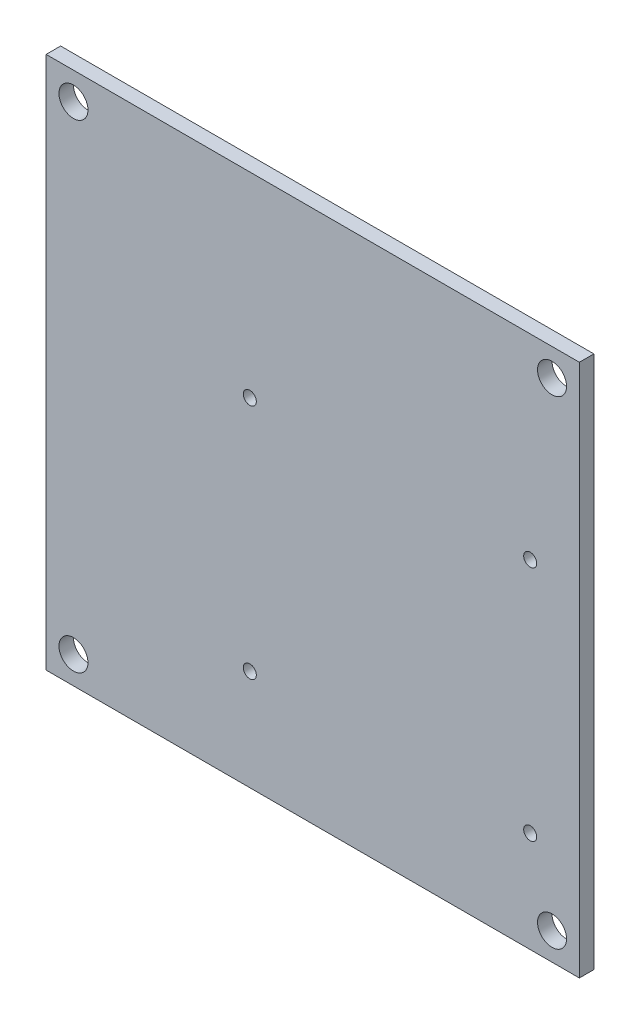
ISO-10303-21;
HEADER;
FILE_DESCRIPTION(('STEP AP214'),'2;1');
FILE_NAME('part.step','',(''),(''),'','','');
FILE_SCHEMA(('AUTOMOTIVE_DESIGN { 1 0 10303 214 1 1 1 1 }'));
ENDSEC;
DATA;
#1=APPLICATION_CONTEXT('core data for automotive mechanical design processes');
#2=APPLICATION_PROTOCOL_DEFINITION('international standard','automotive_design',2000,#1);
#3=PRODUCT_CONTEXT('',#1,'mechanical');
#4=PRODUCT('Part','Part','',(#3));
#5=PRODUCT_RELATED_PRODUCT_CATEGORY('part','',(#4));
#6=PRODUCT_DEFINITION_FORMATION('','',#4);
#7=PRODUCT_DEFINITION_CONTEXT('part definition',#1,'design');
#8=PRODUCT_DEFINITION('design','',#6,#7);
#9=PRODUCT_DEFINITION_SHAPE('','',#8);
#10=(LENGTH_UNIT() NAMED_UNIT(*) SI_UNIT(.MILLI.,.METRE.));
#11=(NAMED_UNIT(*) PLANE_ANGLE_UNIT() SI_UNIT($,.RADIAN.));
#12=(NAMED_UNIT(*) SI_UNIT($,.STERADIAN.) SOLID_ANGLE_UNIT());
#13=UNCERTAINTY_MEASURE_WITH_UNIT(LENGTH_MEASURE(1.E-05),#10,'distance_accuracy_value','');
#14=(GEOMETRIC_REPRESENTATION_CONTEXT(3) GLOBAL_UNCERTAINTY_ASSIGNED_CONTEXT((#13)) GLOBAL_UNIT_ASSIGNED_CONTEXT((#10,
#11,#12)) REPRESENTATION_CONTEXT('',''));
#15=CARTESIAN_POINT('',(0.,0.,0.));
#16=DIRECTION('',(0.,0.,1.));
#17=DIRECTION('',(1.,0.,0.));
#18=AXIS2_PLACEMENT_3D('',#15,#16,#17);
#19=CARTESIAN_POINT('',(-80.0459061808555,-48.4539841049576,998.500000000007));
#20=DIRECTION('',(-1.,0.,0.));
#21=DIRECTION('',(0.,0.,1.));
#22=AXIS2_PLACEMENT_3D('',#19,#20,#21);
#23=PLANE('',#22);
#24=DIRECTION('',(0.,-1.,0.));
#25=VECTOR('',#24,1.);
#26=CARTESIAN_POINT('',(-80.0459061808555,-48.4539841049576,1001.50000000001));
#27=LINE('',#26,#25);
#28=CARTESIAN_POINT('',(-80.0459061808555,61.854673760144,1001.50000000001));
#29=VERTEX_POINT('',#28);
#30=CARTESIAN_POINT('',(-80.0459061808555,-48.4539841049576,1001.50000000001));
#31=VERTEX_POINT('',#30);
#32=EDGE_CURVE('E104',#29,#31,#27,.T.);
#33=ORIENTED_EDGE('',*,*,#32,.F.);
#34=DIRECTION('',(0.,0.,1.));
#35=VECTOR('',#34,1.);
#36=CARTESIAN_POINT('',(-80.0459061808555,61.854673760144,998.500000000007));
#37=LINE('',#36,#35);
#38=CARTESIAN_POINT('',(-80.0459061808555,61.854673760144,998.500000000007));
#39=VERTEX_POINT('',#38);
#40=EDGE_CURVE('E11',#39,#29,#37,.T.);
#41=ORIENTED_EDGE('',*,*,#40,.F.);
#42=DIRECTION('',(0.,-1.,0.));
#43=VECTOR('',#42,1.);
#44=CARTESIAN_POINT('',(-80.0459061808555,-48.4539841049576,998.500000000007));
#45=LINE('',#44,#43);
#46=CARTESIAN_POINT('',(-80.0459061808555,-48.4539841049576,998.500000000007));
#47=VERTEX_POINT('',#46);
#48=EDGE_CURVE('E97',#39,#47,#45,.T.);
#49=ORIENTED_EDGE('',*,*,#48,.T.);
#50=DIRECTION('',(0.,0.,1.));
#51=VECTOR('',#50,1.);
#52=CARTESIAN_POINT('',(-80.0459061808555,-48.4539841049576,998.500000000007));
#53=LINE('',#52,#51);
#54=EDGE_CURVE('E42',#47,#31,#53,.T.);
#55=ORIENTED_EDGE('',*,*,#54,.T.);
#56=EDGE_LOOP('',(#33,#41,#49,#55));
#57=FACE_BOUND('',#56,.T.);
#58=ADVANCED_FACE('F39',(#57),#23,.T.);
#59=CARTESIAN_POINT('',(-80.0459061808555,61.854673760144,998.500000000007));
#60=DIRECTION('',(0.,1.,0.));
#61=DIRECTION('',(0.,0.,1.));
#62=AXIS2_PLACEMENT_3D('',#59,#60,#61);
#63=PLANE('',#62);
#64=DIRECTION('',(-1.,0.,0.));
#65=VECTOR('',#64,1.);
#66=CARTESIAN_POINT('',(-80.0459061808555,61.854673760144,1001.50000000001));
#67=LINE('',#66,#65);
#68=CARTESIAN_POINT('',(30.2627516842457,61.854673760144,1001.50000000001));
#69=VERTEX_POINT('',#68);
#70=EDGE_CURVE('E99',#69,#29,#67,.T.);
#71=ORIENTED_EDGE('',*,*,#70,.F.);
#72=DIRECTION('',(0.,0.,1.));
#73=VECTOR('',#72,1.);
#74=CARTESIAN_POINT('',(30.2627516842457,61.854673760144,998.500000000007));
#75=LINE('',#74,#73);
#76=CARTESIAN_POINT('',(30.2627516842457,61.854673760144,998.500000000007));
#77=VERTEX_POINT('',#76);
#78=EDGE_CURVE('E48',#77,#69,#75,.T.);
#79=ORIENTED_EDGE('',*,*,#78,.F.);
#80=DIRECTION('',(-1.,0.,0.));
#81=VECTOR('',#80,1.);
#82=CARTESIAN_POINT('',(-80.0459061808555,61.854673760144,998.500000000007));
#83=LINE('',#82,#81);
#84=EDGE_CURVE('E94',#77,#39,#83,.T.);
#85=ORIENTED_EDGE('',*,*,#84,.T.);
#86=ORIENTED_EDGE('',*,*,#40,.T.);
#87=EDGE_LOOP('',(#71,#79,#85,#86));
#88=FACE_BOUND('',#87,.T.);
#89=ADVANCED_FACE('F115',(#88),#63,.T.);
#90=CARTESIAN_POINT('',(30.2627516842457,-48.4539841049576,998.500000000007));
#91=DIRECTION('',(1.,0.,0.));
#92=DIRECTION('',(0.,0.,-1.));
#93=AXIS2_PLACEMENT_3D('',#90,#91,#92);
#94=PLANE('',#93);
#95=DIRECTION('',(0.,1.,0.));
#96=VECTOR('',#95,1.);
#97=CARTESIAN_POINT('',(30.2627516842457,-48.4539841049576,1001.50000000001));
#98=LINE('',#97,#96);
#99=CARTESIAN_POINT('',(30.2627516842457,-48.4539841049576,1001.50000000001));
#100=VERTEX_POINT('',#99);
#101=EDGE_CURVE('E89',#100,#69,#98,.T.);
#102=ORIENTED_EDGE('',*,*,#101,.F.);
#103=DIRECTION('',(0.,0.,1.));
#104=VECTOR('',#103,1.);
#105=CARTESIAN_POINT('',(30.2627516842457,-48.4539841049576,998.500000000007));
#106=LINE('',#105,#104);
#107=CARTESIAN_POINT('',(30.2627516842457,-48.4539841049576,998.500000000007));
#108=VERTEX_POINT('',#107);
#109=EDGE_CURVE('E84',#108,#100,#106,.T.);
#110=ORIENTED_EDGE('',*,*,#109,.F.);
#111=DIRECTION('',(0.,1.,0.));
#112=VECTOR('',#111,1.);
#113=CARTESIAN_POINT('',(30.2627516842457,-48.4539841049576,998.500000000007));
#114=LINE('',#113,#112);
#115=EDGE_CURVE('E87',#108,#77,#114,.T.);
#116=ORIENTED_EDGE('',*,*,#115,.T.);
#117=ORIENTED_EDGE('',*,*,#78,.T.);
#118=EDGE_LOOP('',(#102,#110,#116,#117));
#119=FACE_BOUND('',#118,.T.);
#120=ADVANCED_FACE('F86',(#119),#94,.T.);
#121=CARTESIAN_POINT('',(-80.0459061808555,-48.4539841049576,998.500000000007));
#122=DIRECTION('',(0.,-1.,0.));
#123=DIRECTION('',(0.,0.,-1.));
#124=AXIS2_PLACEMENT_3D('',#121,#122,#123);
#125=PLANE('',#124);
#126=DIRECTION('',(1.,0.,0.));
#127=VECTOR('',#126,1.);
#128=CARTESIAN_POINT('',(-80.0459061808555,-48.4539841049576,1001.50000000001));
#129=LINE('',#128,#127);
#130=EDGE_CURVE('E107',#31,#100,#129,.T.);
#131=ORIENTED_EDGE('',*,*,#130,.F.);
#132=ORIENTED_EDGE('',*,*,#54,.F.);
#133=DIRECTION('',(1.,0.,0.));
#134=VECTOR('',#133,1.);
#135=CARTESIAN_POINT('',(-80.0459061808555,-48.4539841049576,998.500000000007));
#136=LINE('',#135,#134);
#137=EDGE_CURVE('E93',#47,#108,#136,.T.);
#138=ORIENTED_EDGE('',*,*,#137,.T.);
#139=ORIENTED_EDGE('',*,*,#109,.T.);
#140=EDGE_LOOP('',(#131,#132,#138,#139));
#141=FACE_BOUND('',#140,.T.);
#142=ADVANCED_FACE('F96',(#141),#125,.T.);
#143=CARTESIAN_POINT('',(0.,0.,998.500000000007));
#144=DIRECTION('',(0.,0.,-1.));
#145=DIRECTION('',(-1.,0.,0.));
#146=AXIS2_PLACEMENT_3D('',#143,#144,#145);
#147=PLANE('',#146);
#148=CARTESIAN_POINT('',(20.0892817663596,21.3992873341535,998.500000000007));
#149=DIRECTION('',(0.,0.,-1.));
#150=DIRECTION('',(-1.,0.,0.));
#151=AXIS2_PLACEMENT_3D('',#148,#149,#150);
#152=CIRCLE('',#151,1.35);
#153=CARTESIAN_POINT('',(18.7392817663596,21.3992873341535,998.500000000007));
#154=VERTEX_POINT('',#153);
#155=EDGE_CURVE('E191',#154,#154,#152,.T.);
#156=ORIENTED_EDGE('',*,*,#155,.F.);
#157=EDGE_LOOP('',(#156));
#158=FACE_BOUND('',#157,.T.);
#159=CARTESIAN_POINT('',(20.0892817663598,-27.6007126658465,998.500000000007));
#160=DIRECTION('',(0.,0.,-1.));
#161=DIRECTION('',(-1.,0.,0.));
#162=AXIS2_PLACEMENT_3D('',#159,#160,#161);
#163=CIRCLE('',#162,1.35000000000014);
#164=CARTESIAN_POINT('',(18.7392817663596,-27.6007126658465,998.500000000007));
#165=VERTEX_POINT('',#164);
#166=EDGE_CURVE('E183',#165,#165,#163,.T.);
#167=ORIENTED_EDGE('',*,*,#166,.F.);
#168=EDGE_LOOP('',(#167));
#169=FACE_BOUND('',#168,.T.);
#170=CARTESIAN_POINT('',(-37.9107182336401,-27.6007126658469,998.500000000007));
#171=DIRECTION('',(0.,0.,-1.));
#172=DIRECTION('',(-1.,0.,0.));
#173=AXIS2_PLACEMENT_3D('',#170,#171,#172);
#174=CIRCLE('',#173,1.35);
#175=CARTESIAN_POINT('',(-39.2607182336401,-27.6007126658469,998.500000000007));
#176=VERTEX_POINT('',#175);
#177=EDGE_CURVE('E176',#176,#176,#174,.T.);
#178=ORIENTED_EDGE('',*,*,#177,.F.);
#179=EDGE_LOOP('',(#178));
#180=FACE_BOUND('',#179,.T.);
#181=CARTESIAN_POINT('',(-37.9107182336406,21.3992873341531,998.500000000007));
#182=DIRECTION('',(0.,0.,-1.));
#183=DIRECTION('',(-1.,0.,0.));
#184=AXIS2_PLACEMENT_3D('',#181,#182,#183);
#185=CIRCLE('',#184,1.35000000000013);
#186=CARTESIAN_POINT('',(-39.2607182336407,21.3992873341531,998.500000000007));
#187=VERTEX_POINT('',#186);
#188=EDGE_CURVE('E178',#187,#187,#185,.T.);
#189=ORIENTED_EDGE('',*,*,#188,.F.);
#190=EDGE_LOOP('',(#189));
#191=FACE_BOUND('',#190,.T.);
#192=CARTESIAN_POINT('',(24.6058974347668,56.1978195106381,998.500000000007));
#193=DIRECTION('',(0.,0.,1.));
#194=DIRECTION('',(1.,0.,0.));
#195=AXIS2_PLACEMENT_3D('',#192,#193,#194);
#196=CIRCLE('',#195,2.99999999999104);
#197=CARTESIAN_POINT('',(27.6058974347579,56.1978195106381,998.500000000007));
#198=VERTEX_POINT('',#197);
#199=EDGE_CURVE('E200',#198,#198,#196,.T.);
#200=ORIENTED_EDGE('',*,*,#199,.T.);
#201=EDGE_LOOP('',(#200));
#202=FACE_BOUND('',#201,.T.);
#203=CARTESIAN_POINT('',(-74.3890519313767,-42.7971298554516,998.500000000007));
#204=DIRECTION('',(0.,0.,1.));
#205=DIRECTION('',(1.,0.,0.));
#206=AXIS2_PLACEMENT_3D('',#203,#204,#205);
#207=CIRCLE('',#206,3.00000000000893);
#208=CARTESIAN_POINT('',(-71.3890519313678,-42.7971298554516,998.500000000007));
#209=VERTEX_POINT('',#208);
#210=EDGE_CURVE('E206',#209,#209,#207,.T.);
#211=ORIENTED_EDGE('',*,*,#210,.T.);
#212=EDGE_LOOP('',(#211));
#213=FACE_BOUND('',#212,.T.);
#214=CARTESIAN_POINT('',(24.6058974347399,-42.7971298554786,998.500000000007));
#215=DIRECTION('',(0.,0.,1.));
#216=DIRECTION('',(1.,0.,0.));
#217=AXIS2_PLACEMENT_3D('',#214,#215,#216);
#218=CIRCLE('',#217,3.00000000001683);
#219=CARTESIAN_POINT('',(27.6058974347567,-42.7971298554786,998.500000000007));
#220=VERTEX_POINT('',#219);
#221=EDGE_CURVE('E212',#220,#220,#218,.T.);
#222=ORIENTED_EDGE('',*,*,#221,.T.);
#223=EDGE_LOOP('',(#222));
#224=FACE_BOUND('',#223,.T.);
#225=CARTESIAN_POINT('',(-74.3890519313498,56.197819510665,998.500000000007));
#226=DIRECTION('',(0.,0.,1.));
#227=DIRECTION('',(1.,0.,0.));
#228=AXIS2_PLACEMENT_3D('',#225,#226,#227);
#229=CIRCLE('',#228,2.99999999998319);
#230=CARTESIAN_POINT('',(-71.3890519313666,56.197819510665,998.500000000007));
#231=VERTEX_POINT('',#230);
#232=EDGE_CURVE('E108',#231,#231,#229,.T.);
#233=ORIENTED_EDGE('',*,*,#232,.T.);
#234=EDGE_LOOP('',(#233));
#235=FACE_BOUND('',#234,.T.);
#236=ORIENTED_EDGE('',*,*,#48,.F.);
#237=ORIENTED_EDGE('',*,*,#84,.F.);
#238=ORIENTED_EDGE('',*,*,#115,.F.);
#239=ORIENTED_EDGE('',*,*,#137,.F.);
#240=EDGE_LOOP('',(#236,#237,#238,#239));
#241=FACE_BOUND('',#240,.T.);
#242=ADVANCED_FACE('F92',(#158,#169,#180,#191,#202,#213,#224,#235,#241),#147,.T.);
#243=CARTESIAN_POINT('',(0.,0.,1001.50000000001));
#244=DIRECTION('',(0.,0.,-1.));
#245=DIRECTION('',(-1.,0.,0.));
#246=AXIS2_PLACEMENT_3D('',#243,#244,#245);
#247=PLANE('',#246);
#248=CARTESIAN_POINT('',(20.0892817663596,21.3992873341535,1001.50000000001));
#249=DIRECTION('',(0.,0.,-1.));
#250=DIRECTION('',(-1.,0.,0.));
#251=AXIS2_PLACEMENT_3D('',#248,#249,#250);
#252=CIRCLE('',#251,1.35);
#253=CARTESIAN_POINT('',(18.7392817663596,21.3992873341535,1001.50000000001));
#254=VERTEX_POINT('',#253);
#255=EDGE_CURVE('E194',#254,#254,#252,.T.);
#256=ORIENTED_EDGE('',*,*,#255,.T.);
#257=EDGE_LOOP('',(#256));
#258=FACE_BOUND('',#257,.T.);
#259=CARTESIAN_POINT('',(20.0892817663598,-27.6007126658465,1001.50000000001));
#260=DIRECTION('',(0.,0.,-1.));
#261=DIRECTION('',(-1.,0.,0.));
#262=AXIS2_PLACEMENT_3D('',#259,#260,#261);
#263=CIRCLE('',#262,1.35000000000014);
#264=CARTESIAN_POINT('',(18.7392817663596,-27.6007126658465,1001.50000000001));
#265=VERTEX_POINT('',#264);
#266=EDGE_CURVE('E188',#265,#265,#263,.T.);
#267=ORIENTED_EDGE('',*,*,#266,.T.);
#268=EDGE_LOOP('',(#267));
#269=FACE_BOUND('',#268,.T.);
#270=CARTESIAN_POINT('',(-37.9107182336401,-27.6007126658469,1001.50000000001));
#271=DIRECTION('',(0.,0.,-1.));
#272=DIRECTION('',(-1.,0.,0.));
#273=AXIS2_PLACEMENT_3D('',#270,#271,#272);
#274=CIRCLE('',#273,1.35);
#275=CARTESIAN_POINT('',(-39.2607182336401,-27.6007126658469,1001.50000000001));
#276=VERTEX_POINT('',#275);
#277=EDGE_CURVE('E173',#276,#276,#274,.T.);
#278=ORIENTED_EDGE('',*,*,#277,.T.);
#279=EDGE_LOOP('',(#278));
#280=FACE_BOUND('',#279,.T.);
#281=CARTESIAN_POINT('',(-37.9107182336406,21.3992873341531,1001.50000000001));
#282=DIRECTION('',(0.,0.,-1.));
#283=DIRECTION('',(-1.,0.,0.));
#284=AXIS2_PLACEMENT_3D('',#281,#282,#283);
#285=CIRCLE('',#284,1.35000000000013);
#286=CARTESIAN_POINT('',(-39.2607182336407,21.3992873341531,1001.50000000001));
#287=VERTEX_POINT('',#286);
#288=EDGE_CURVE('E181',#287,#287,#285,.T.);
#289=ORIENTED_EDGE('',*,*,#288,.T.);
#290=EDGE_LOOP('',(#289));
#291=FACE_BOUND('',#290,.T.);
#292=CARTESIAN_POINT('',(24.6058974347668,56.1978195106381,1001.50000000001));
#293=DIRECTION('',(0.,0.,1.));
#294=DIRECTION('',(1.,0.,0.));
#295=AXIS2_PLACEMENT_3D('',#292,#293,#294);
#296=CIRCLE('',#295,2.99999999999104);
#297=CARTESIAN_POINT('',(27.6058974347579,56.1978195106381,1001.50000000001));
#298=VERTEX_POINT('',#297);
#299=EDGE_CURVE('E198',#298,#298,#296,.T.);
#300=ORIENTED_EDGE('',*,*,#299,.F.);
#301=EDGE_LOOP('',(#300));
#302=FACE_BOUND('',#301,.T.);
#303=CARTESIAN_POINT('',(-74.3890519313767,-42.7971298554516,1001.50000000001));
#304=DIRECTION('',(0.,0.,1.));
#305=DIRECTION('',(1.,0.,0.));
#306=AXIS2_PLACEMENT_3D('',#303,#304,#305);
#307=CIRCLE('',#306,3.00000000000893);
#308=CARTESIAN_POINT('',(-71.3890519313678,-42.7971298554516,1001.50000000001));
#309=VERTEX_POINT('',#308);
#310=EDGE_CURVE('E203',#309,#309,#307,.T.);
#311=ORIENTED_EDGE('',*,*,#310,.F.);
#312=EDGE_LOOP('',(#311));
#313=FACE_BOUND('',#312,.T.);
#314=CARTESIAN_POINT('',(24.6058974347399,-42.7971298554786,1001.50000000001));
#315=DIRECTION('',(0.,0.,1.));
#316=DIRECTION('',(1.,0.,0.));
#317=AXIS2_PLACEMENT_3D('',#314,#315,#316);
#318=CIRCLE('',#317,3.00000000001683);
#319=CARTESIAN_POINT('',(27.6058974347567,-42.7971298554786,1001.50000000001));
#320=VERTEX_POINT('',#319);
#321=EDGE_CURVE('E209',#320,#320,#318,.T.);
#322=ORIENTED_EDGE('',*,*,#321,.F.);
#323=EDGE_LOOP('',(#322));
#324=FACE_BOUND('',#323,.T.);
#325=CARTESIAN_POINT('',(-74.3890519313498,56.197819510665,1001.50000000001));
#326=DIRECTION('',(0.,0.,1.));
#327=DIRECTION('',(1.,0.,0.));
#328=AXIS2_PLACEMENT_3D('',#325,#326,#327);
#329=CIRCLE('',#328,2.99999999998319);
#330=CARTESIAN_POINT('',(-71.3890519313666,56.197819510665,1001.50000000001));
#331=VERTEX_POINT('',#330);
#332=EDGE_CURVE('E215',#331,#331,#329,.T.);
#333=ORIENTED_EDGE('',*,*,#332,.F.);
#334=EDGE_LOOP('',(#333));
#335=FACE_BOUND('',#334,.T.);
#336=ORIENTED_EDGE('',*,*,#32,.T.);
#337=ORIENTED_EDGE('',*,*,#130,.T.);
#338=ORIENTED_EDGE('',*,*,#101,.T.);
#339=ORIENTED_EDGE('',*,*,#70,.T.);
#340=EDGE_LOOP('',(#336,#337,#338,#339));
#341=FACE_BOUND('',#340,.T.);
#342=ADVANCED_FACE('F114',(#258,#269,#280,#291,#302,#313,#324,#335,#341),#247,.F.);
#343=CARTESIAN_POINT('',(-74.3890519313498,56.197819510665,998.500000000007));
#344=DIRECTION('',(0.,0.,1.));
#345=DIRECTION('',(1.,0.,0.));
#346=AXIS2_PLACEMENT_3D('',#343,#344,#345);
#347=CYLINDRICAL_SURFACE('',#346,2.99999999998319);
#348=ORIENTED_EDGE('',*,*,#232,.F.);
#349=EDGE_LOOP('',(#348));
#350=FACE_BOUND('',#349,.T.);
#351=ORIENTED_EDGE('',*,*,#332,.T.);
#352=EDGE_LOOP('',(#351));
#353=FACE_BOUND('',#352,.T.);
#354=ADVANCED_FACE('F133',(#350,#353),#347,.F.);
#355=CARTESIAN_POINT('',(24.6058974347399,-42.7971298554786,998.500000000007));
#356=DIRECTION('',(0.,0.,1.));
#357=DIRECTION('',(1.,0.,0.));
#358=AXIS2_PLACEMENT_3D('',#355,#356,#357);
#359=CYLINDRICAL_SURFACE('',#358,3.00000000001683);
#360=ORIENTED_EDGE('',*,*,#221,.F.);
#361=EDGE_LOOP('',(#360));
#362=FACE_BOUND('',#361,.T.);
#363=ORIENTED_EDGE('',*,*,#321,.T.);
#364=EDGE_LOOP('',(#363));
#365=FACE_BOUND('',#364,.T.);
#366=ADVANCED_FACE('F140',(#362,#365),#359,.F.);
#367=CARTESIAN_POINT('',(-74.3890519313767,-42.7971298554516,998.500000000007));
#368=DIRECTION('',(0.,0.,1.));
#369=DIRECTION('',(1.,0.,0.));
#370=AXIS2_PLACEMENT_3D('',#367,#368,#369);
#371=CYLINDRICAL_SURFACE('',#370,3.00000000000893);
#372=ORIENTED_EDGE('',*,*,#210,.F.);
#373=EDGE_LOOP('',(#372));
#374=FACE_BOUND('',#373,.T.);
#375=ORIENTED_EDGE('',*,*,#310,.T.);
#376=EDGE_LOOP('',(#375));
#377=FACE_BOUND('',#376,.T.);
#378=ADVANCED_FACE('F144',(#374,#377),#371,.F.);
#379=CARTESIAN_POINT('',(24.6058974347668,56.1978195106381,998.500000000007));
#380=DIRECTION('',(0.,0.,1.));
#381=DIRECTION('',(1.,0.,0.));
#382=AXIS2_PLACEMENT_3D('',#379,#380,#381);
#383=CYLINDRICAL_SURFACE('',#382,2.99999999999104);
#384=ORIENTED_EDGE('',*,*,#199,.F.);
#385=EDGE_LOOP('',(#384));
#386=FACE_BOUND('',#385,.T.);
#387=ORIENTED_EDGE('',*,*,#299,.T.);
#388=EDGE_LOOP('',(#387));
#389=FACE_BOUND('',#388,.T.);
#390=ADVANCED_FACE('F148',(#386,#389),#383,.F.);
#391=CARTESIAN_POINT('',(-37.9107182336406,21.3992873341531,1001.50000000001));
#392=DIRECTION('',(0.,0.,-1.));
#393=DIRECTION('',(-1.,0.,0.));
#394=AXIS2_PLACEMENT_3D('',#391,#392,#393);
#395=CYLINDRICAL_SURFACE('',#394,1.35000000000013);
#396=ORIENTED_EDGE('',*,*,#288,.F.);
#397=EDGE_LOOP('',(#396));
#398=FACE_BOUND('',#397,.T.);
#399=ORIENTED_EDGE('',*,*,#188,.T.);
#400=EDGE_LOOP('',(#399));
#401=FACE_BOUND('',#400,.T.);
#402=ADVANCED_FACE('F152',(#398,#401),#395,.F.);
#403=CARTESIAN_POINT('',(-37.9107182336401,-27.6007126658469,1001.50000000001));
#404=DIRECTION('',(0.,0.,-1.));
#405=DIRECTION('',(-1.,0.,0.));
#406=AXIS2_PLACEMENT_3D('',#403,#404,#405);
#407=CYLINDRICAL_SURFACE('',#406,1.35);
#408=ORIENTED_EDGE('',*,*,#277,.F.);
#409=EDGE_LOOP('',(#408));
#410=FACE_BOUND('',#409,.T.);
#411=ORIENTED_EDGE('',*,*,#177,.T.);
#412=EDGE_LOOP('',(#411));
#413=FACE_BOUND('',#412,.T.);
#414=ADVANCED_FACE('F156',(#410,#413),#407,.F.);
#415=CARTESIAN_POINT('',(20.0892817663598,-27.6007126658465,1001.50000000001));
#416=DIRECTION('',(0.,0.,-1.));
#417=DIRECTION('',(-1.,0.,0.));
#418=AXIS2_PLACEMENT_3D('',#415,#416,#417);
#419=CYLINDRICAL_SURFACE('',#418,1.35000000000014);
#420=ORIENTED_EDGE('',*,*,#266,.F.);
#421=EDGE_LOOP('',(#420));
#422=FACE_BOUND('',#421,.T.);
#423=ORIENTED_EDGE('',*,*,#166,.T.);
#424=EDGE_LOOP('',(#423));
#425=FACE_BOUND('',#424,.T.);
#426=ADVANCED_FACE('F161',(#422,#425),#419,.F.);
#427=CARTESIAN_POINT('',(20.0892817663596,21.3992873341535,1001.50000000001));
#428=DIRECTION('',(0.,0.,-1.));
#429=DIRECTION('',(-1.,0.,0.));
#430=AXIS2_PLACEMENT_3D('',#427,#428,#429);
#431=CYLINDRICAL_SURFACE('',#430,1.35);
#432=ORIENTED_EDGE('',*,*,#255,.F.);
#433=EDGE_LOOP('',(#432));
#434=FACE_BOUND('',#433,.T.);
#435=ORIENTED_EDGE('',*,*,#155,.T.);
#436=EDGE_LOOP('',(#435));
#437=FACE_BOUND('',#436,.T.);
#438=ADVANCED_FACE('F158',(#434,#437),#431,.F.);
#439=CLOSED_SHELL('',(#58,#89,#120,#142,#242,#342,#354,#366,#378,#390,#402,#414,#426,#438));
#440=MANIFOLD_SOLID_BREP('B2',#439);
#441=ADVANCED_BREP_SHAPE_REPRESENTATION('',(#18,#440),#14);
#442=SHAPE_DEFINITION_REPRESENTATION(#9,#441);
ENDSEC;
END-ISO-10303-21;
